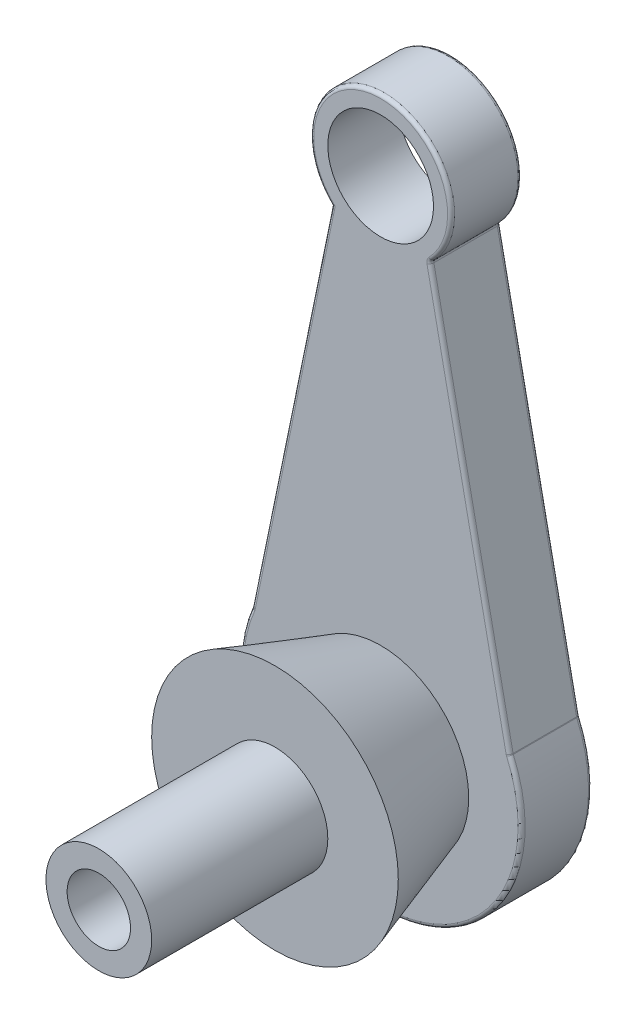
ISO-10303-21;
HEADER;
FILE_DESCRIPTION(('STEP AP214'),'2;1');
FILE_NAME('part.step','',(''),(''),'','','');
FILE_SCHEMA(('AUTOMOTIVE_DESIGN { 1 0 10303 214 1 1 1 1 }'));
ENDSEC;
DATA;
#1=APPLICATION_CONTEXT('core data for automotive mechanical design processes');
#2=APPLICATION_PROTOCOL_DEFINITION('international standard','automotive_design',2000,#1);
#3=PRODUCT_CONTEXT('',#1,'mechanical');
#4=PRODUCT('Part','Part','',(#3));
#5=PRODUCT_RELATED_PRODUCT_CATEGORY('part','',(#4));
#6=PRODUCT_DEFINITION_FORMATION('','',#4);
#7=PRODUCT_DEFINITION_CONTEXT('part definition',#1,'design');
#8=PRODUCT_DEFINITION('design','',#6,#7);
#9=PRODUCT_DEFINITION_SHAPE('','',#8);
#10=(LENGTH_UNIT() NAMED_UNIT(*) SI_UNIT(.MILLI.,.METRE.));
#11=(NAMED_UNIT(*) PLANE_ANGLE_UNIT() SI_UNIT($,.RADIAN.));
#12=(NAMED_UNIT(*) SI_UNIT($,.STERADIAN.) SOLID_ANGLE_UNIT());
#13=UNCERTAINTY_MEASURE_WITH_UNIT(LENGTH_MEASURE(1.E-05),#10,'distance_accuracy_value','');
#14=(GEOMETRIC_REPRESENTATION_CONTEXT(3) GLOBAL_UNCERTAINTY_ASSIGNED_CONTEXT((#13)) GLOBAL_UNIT_ASSIGNED_CONTEXT((#10,
#11,#12)) REPRESENTATION_CONTEXT('',''));
#15=CARTESIAN_POINT('',(0.,0.,0.));
#16=DIRECTION('',(0.,0.,1.));
#17=DIRECTION('',(1.,0.,0.));
#18=AXIS2_PLACEMENT_3D('',#15,#16,#17);
#19=CARTESIAN_POINT('',(0.,19.7994731740284,-10.));
#20=DIRECTION('',(0.,0.,-1.));
#21=DIRECTION('',(-1.,0.,0.));
#22=AXIS2_PLACEMENT_3D('',#19,#20,#21);
#23=PLANE('',#22);
#24=CARTESIAN_POINT('',(0.,19.7994731740284,-10.));
#25=DIRECTION('',(0.,0.,1.));
#26=DIRECTION('',(1.,0.,0.));
#27=AXIS2_PLACEMENT_3D('',#24,#25,#26);
#28=CIRCLE('',#27,7.5);
#29=CARTESIAN_POINT('',(7.5,19.7994731740284,-10.));
#30=VERTEX_POINT('',#29);
#31=EDGE_CURVE('E162',#30,#30,#28,.T.);
#32=ORIENTED_EDGE('',*,*,#31,.T.);
#33=EDGE_LOOP('',(#32));
#34=FACE_BOUND('',#33,.T.);
#35=CARTESIAN_POINT('',(0.,-50.4005268259715,-10.));
#36=DIRECTION('',(0.,0.,-1.));
#37=DIRECTION('',(-1.,0.,0.));
#38=AXIS2_PLACEMENT_3D('',#35,#36,#37);
#39=CIRCLE('',#38,13.);
#40=CARTESIAN_POINT('',(-13.,-50.4005268259715,-10.));
#41=VERTEX_POINT('',#40);
#42=EDGE_CURVE('E313',#41,#41,#39,.T.);
#43=ORIENTED_EDGE('',*,*,#42,.F.);
#44=EDGE_LOOP('',(#43));
#45=FACE_BOUND('',#44,.T.);
#46=CARTESIAN_POINT('',(-18.7837465075432,-42.1895057481543,-10.));
#47=DIRECTION('',(0.,0.,-1.));
#48=DIRECTION('',(-1.,0.,0.));
#49=AXIS2_PLACEMENT_3D('',#46,#47,#48);
#50=CIRCLE('',#49,1.);
#51=CARTESIAN_POINT('',(-17.8042230323169,-42.3908357297282,-10.));
#52=VERTEX_POINT('',#51);
#53=CARTESIAN_POINT('',(-17.8674661901021,-42.5900433617064,-10.));
#54=VERTEX_POINT('',#53);
#55=EDGE_CURVE('E195',#52,#54,#50,.T.);
#56=ORIENTED_EDGE('',*,*,#55,.F.);
#57=DIRECTION('',(-0.201329981573842,-0.979523475226335,0.));
#58=VECTOR('',#57,1.);
#59=CARTESIAN_POINT('',(-4.81815909070258,20.789791329218,-10.));
#60=LINE('',#59,#58);
#61=CARTESIAN_POINT('',(-6.45444816208308,12.828813311219,-10.));
#62=VERTEX_POINT('',#61);
#63=EDGE_CURVE('E193',#52,#62,#60,.F.);
#64=ORIENTED_EDGE('',*,*,#63,.T.);
#65=CARTESIAN_POINT('',(0.,19.7994731740284,-10.));
#66=DIRECTION('',(0.,0.,-1.));
#67=DIRECTION('',(-1.,0.,0.));
#68=AXIS2_PLACEMENT_3D('',#65,#66,#67);
#69=CIRCLE('',#68,9.5);
#70=CARTESIAN_POINT('',(6.82531586816918,13.1915186266879,-10.));
#71=VERTEX_POINT('',#70);
#72=EDGE_CURVE('E167',#62,#71,#69,.T.);
#73=ORIENTED_EDGE('',*,*,#72,.T.);
#74=CARTESIAN_POINT('',(7.54377017008172,12.49594446381,-10.));
#75=DIRECTION('',(0.,0.,-1.));
#76=DIRECTION('',(-1.,0.,0.));
#77=AXIS2_PLACEMENT_3D('',#74,#75,#76);
#78=CIRCLE('',#77,1.);
#79=CARTESIAN_POINT('',(6.56424669485539,12.2946144822362,-10.));
#80=VERTEX_POINT('',#79);
#81=EDGE_CURVE('E189',#80,#71,#78,.T.);
#82=ORIENTED_EDGE('',*,*,#81,.F.);
#83=DIRECTION('',(-0.201329981573842,0.979523475226335,0.));
#84=VECTOR('',#83,1.);
#85=CARTESIAN_POINT('',(4.81815909070258,20.789791329218,-10.));
#86=LINE('',#85,#84);
#87=CARTESIAN_POINT('',(17.8042230323169,-42.3908357297282,-10.));
#88=VERTEX_POINT('',#87);
#89=EDGE_CURVE('E180',#80,#88,#86,.F.);
#90=ORIENTED_EDGE('',*,*,#89,.T.);
#91=CARTESIAN_POINT('',(18.7837465075432,-42.1895057481543,-10.));
#92=DIRECTION('',(0.,0.,-1.));
#93=DIRECTION('',(-1.,0.,0.));
#94=AXIS2_PLACEMENT_3D('',#91,#92,#93);
#95=CIRCLE('',#94,1.);
#96=CARTESIAN_POINT('',(17.8674661901021,-42.5900433617064,-10.));
#97=VERTEX_POINT('',#96);
#98=EDGE_CURVE('E177',#97,#88,#95,.T.);
#99=ORIENTED_EDGE('',*,*,#98,.F.);
#100=CARTESIAN_POINT('',(0.,-50.4005268259715,-10.));
#101=DIRECTION('',(0.,0.,-1.));
#102=DIRECTION('',(-1.,0.,0.));
#103=AXIS2_PLACEMENT_3D('',#100,#101,#102);
#104=CIRCLE('',#103,19.5);
#105=EDGE_CURVE('E187',#97,#54,#104,.T.);
#106=ORIENTED_EDGE('',*,*,#105,.T.);
#107=EDGE_LOOP('',(#56,#64,#73,#82,#90,#99,#106));
#108=FACE_BOUND('',#107,.T.);
#109=ADVANCED_FACE('F40',(#34,#45,#108),#23,.T.);
#110=CARTESIAN_POINT('',(0.,19.7994731740284,-10.));
#111=DIRECTION('',(0.,0.,1.));
#112=DIRECTION('',(1.,0.,0.));
#113=AXIS2_PLACEMENT_3D('',#110,#111,#112);
#114=CYLINDRICAL_SURFACE('',#113,10.);
#115=DIRECTION('',(0.,0.,1.));
#116=VECTOR('',#115,1.);
#117=CARTESIAN_POINT('',(7.18454301912545,12.843731545249,-10.));
#118=LINE('',#117,#116);
#119=CARTESIAN_POINT('',(7.18454301912545,12.843731545249,-0.5));
#120=VERTEX_POINT('',#119);
#121=CARTESIAN_POINT('',(7.18454301912545,12.843731545249,-9.5));
#122=VERTEX_POINT('',#121);
#123=EDGE_CURVE('E146',#120,#122,#118,.F.);
#124=ORIENTED_EDGE('',*,*,#123,.T.);
#125=CARTESIAN_POINT('',(0.,19.7994731740284,-9.5));
#126=DIRECTION('',(0.,0.,-1.));
#127=DIRECTION('',(-1.,0.,0.));
#128=AXIS2_PLACEMENT_3D('',#125,#126,#127);
#129=CIRCLE('',#128,10.);
#130=CARTESIAN_POINT('',(-7.,12.6580447454856,-9.5));
#131=VERTEX_POINT('',#130);
#132=EDGE_CURVE('E140',#122,#131,#129,.F.);
#133=ORIENTED_EDGE('',*,*,#132,.T.);
#134=DIRECTION('',(0.,0.,1.));
#135=VECTOR('',#134,1.);
#136=CARTESIAN_POINT('',(-7.,12.6580447454856,-10.));
#137=LINE('',#136,#135);
#138=CARTESIAN_POINT('',(-7.,12.6580447454856,-0.5));
#139=VERTEX_POINT('',#138);
#140=EDGE_CURVE('E143',#131,#139,#137,.T.);
#141=ORIENTED_EDGE('',*,*,#140,.T.);
#142=CARTESIAN_POINT('',(0.,19.7994731740284,-0.5));
#143=DIRECTION('',(0.,0.,-1.));
#144=DIRECTION('',(-1.,0.,0.));
#145=AXIS2_PLACEMENT_3D('',#142,#143,#144);
#146=CIRCLE('',#145,10.);
#147=EDGE_CURVE('E152',#139,#120,#146,.T.);
#148=ORIENTED_EDGE('',*,*,#147,.T.);
#149=EDGE_LOOP('',(#124,#133,#141,#148));
#150=FACE_BOUND('',#149,.T.);
#151=ADVANCED_FACE('F142',(#150),#114,.T.);
#152=CARTESIAN_POINT('',(7.,12.6580447454856,-10.));
#153=DIRECTION('',(0.979523475226335,0.201329981573842,0.));
#154=DIRECTION('',(-0.201329981573842,0.979523475226335,0.));
#155=AXIS2_PLACEMENT_3D('',#152,#153,#154);
#156=PLANE('',#155);
#157=DIRECTION('',(-0.201329981573842,0.979523475226335,0.));
#158=VECTOR('',#157,1.);
#159=CARTESIAN_POINT('',(7.,12.6580447454856,-9.5));
#160=LINE('',#159,#158);
#161=CARTESIAN_POINT('',(18.29398476993,-42.2901707389412,-9.5));
#162=VERTEX_POINT('',#161);
#163=CARTESIAN_POINT('',(7.05400843246855,12.3952794730231,-9.5));
#164=VERTEX_POINT('',#163);
#165=EDGE_CURVE('E49',#162,#164,#160,.T.);
#166=ORIENTED_EDGE('',*,*,#165,.T.);
#167=DIRECTION('',(0.,0.,-1.));
#168=VECTOR('',#167,1.);
#169=CARTESIAN_POINT('',(7.05400843246855,12.3952794730231,0.));
#170=LINE('',#169,#168);
#171=CARTESIAN_POINT('',(7.05400843246855,12.3952794730231,-0.5));
#172=VERTEX_POINT('',#171);
#173=EDGE_CURVE('E12',#164,#172,#170,.F.);
#174=ORIENTED_EDGE('',*,*,#173,.T.);
#175=DIRECTION('',(-0.201329981573842,0.979523475226335,0.));
#176=VECTOR('',#175,1.);
#177=CARTESIAN_POINT('',(18.3046284919335,-42.3419552545144,-0.5));
#178=LINE('',#177,#176);
#179=CARTESIAN_POINT('',(18.29398476993,-42.2901707389412,-0.5));
#180=VERTEX_POINT('',#179);
#181=EDGE_CURVE('E225',#172,#180,#178,.F.);
#182=ORIENTED_EDGE('',*,*,#181,.T.);
#183=DIRECTION('',(0.,0.,-1.));
#184=VECTOR('',#183,1.);
#185=CARTESIAN_POINT('',(18.29398476993,-42.2901707389412,-10.));
#186=LINE('',#185,#184);
#187=EDGE_CURVE('E60',#180,#162,#186,.T.);
#188=ORIENTED_EDGE('',*,*,#187,.T.);
#189=EDGE_LOOP('',(#166,#174,#182,#188));
#190=FACE_BOUND('',#189,.T.);
#191=ADVANCED_FACE('F448',(#190),#156,.T.);
#192=CARTESIAN_POINT('',(0.,-50.4005268259715,-10.));
#193=DIRECTION('',(0.,0.,1.));
#194=DIRECTION('',(1.,0.,0.));
#195=AXIS2_PLACEMENT_3D('',#192,#193,#194);
#196=CYLINDRICAL_SURFACE('',#195,20.);
#197=DIRECTION('',(0.,0.,1.));
#198=VECTOR('',#197,1.);
#199=CARTESIAN_POINT('',(-18.3256063488226,-42.3897745549304,-10.));
#200=LINE('',#199,#198);
#201=CARTESIAN_POINT('',(-18.3256063488226,-42.3897745549304,-0.5));
#202=VERTEX_POINT('',#201);
#203=CARTESIAN_POINT('',(-18.3256063488226,-42.3897745549304,-9.5));
#204=VERTEX_POINT('',#203);
#205=EDGE_CURVE('E220',#202,#204,#200,.F.);
#206=ORIENTED_EDGE('',*,*,#205,.T.);
#207=CARTESIAN_POINT('',(0.,-50.4005268259715,-9.5));
#208=DIRECTION('',(0.,0.,-1.));
#209=DIRECTION('',(-1.,0.,0.));
#210=AXIS2_PLACEMENT_3D('',#207,#208,#209);
#211=CIRCLE('',#210,20.);
#212=CARTESIAN_POINT('',(18.3256063488226,-42.3897745549304,-9.5));
#213=VERTEX_POINT('',#212);
#214=EDGE_CURVE('E222',#204,#213,#211,.F.);
#215=ORIENTED_EDGE('',*,*,#214,.T.);
#216=DIRECTION('',(0.,0.,1.));
#217=VECTOR('',#216,1.);
#218=CARTESIAN_POINT('',(18.3256063488226,-42.3897745549304,-10.));
#219=LINE('',#218,#217);
#220=CARTESIAN_POINT('',(18.3256063488226,-42.3897745549304,-0.5));
#221=VERTEX_POINT('',#220);
#222=EDGE_CURVE('E151',#213,#221,#219,.T.);
#223=ORIENTED_EDGE('',*,*,#222,.T.);
#224=CARTESIAN_POINT('',(0.,-50.4005268259715,-0.5));
#225=DIRECTION('',(0.,0.,-1.));
#226=DIRECTION('',(-1.,0.,0.));
#227=AXIS2_PLACEMENT_3D('',#224,#225,#226);
#228=CIRCLE('',#227,20.);
#229=EDGE_CURVE('E218',#221,#202,#228,.T.);
#230=ORIENTED_EDGE('',*,*,#229,.T.);
#231=EDGE_LOOP('',(#206,#215,#223,#230));
#232=FACE_BOUND('',#231,.T.);
#233=ADVANCED_FACE('F438',(#232),#196,.T.);
#234=CARTESIAN_POINT('',(-7.,12.6580447454856,-10.));
#235=DIRECTION('',(-0.979523475226335,0.201329981573842,0.));
#236=DIRECTION('',(-0.201329981573842,-0.979523475226335,0.));
#237=AXIS2_PLACEMENT_3D('',#234,#235,#236);
#238=PLANE('',#237);
#239=ORIENTED_EDGE('',*,*,#140,.F.);
#240=DIRECTION('',(-0.201329981573842,-0.979523475226335,0.));
#241=VECTOR('',#240,1.);
#242=CARTESIAN_POINT('',(-7.,12.6580447454856,-9.5));
#243=LINE('',#242,#241);
#244=CARTESIAN_POINT('',(-18.29398476993,-42.2901707389413,-9.5));
#245=VERTEX_POINT('',#244);
#246=EDGE_CURVE('E158',#131,#245,#243,.T.);
#247=ORIENTED_EDGE('',*,*,#246,.T.);
#248=DIRECTION('',(0.,0.,-1.));
#249=VECTOR('',#248,1.);
#250=CARTESIAN_POINT('',(-18.29398476993,-42.2901707389413,0.));
#251=LINE('',#250,#249);
#252=CARTESIAN_POINT('',(-18.29398476993,-42.2901707389413,-0.5));
#253=VERTEX_POINT('',#252);
#254=EDGE_CURVE('E182',#245,#253,#251,.F.);
#255=ORIENTED_EDGE('',*,*,#254,.T.);
#256=DIRECTION('',(-0.201329981573842,-0.979523475226335,0.));
#257=VECTOR('',#256,1.);
#258=CARTESIAN_POINT('',(-7.,12.6580447454856,-0.5));
#259=LINE('',#258,#257);
#260=EDGE_CURVE('E160',#253,#139,#259,.F.);
#261=ORIENTED_EDGE('',*,*,#260,.T.);
#262=EDGE_LOOP('',(#239,#247,#255,#261));
#263=FACE_BOUND('',#262,.T.);
#264=ADVANCED_FACE('F156',(#263),#238,.T.);
#265=CARTESIAN_POINT('',(0.,19.7994731740284,0.));
#266=DIRECTION('',(0.,0.,-1.));
#267=DIRECTION('',(-1.,0.,0.));
#268=AXIS2_PLACEMENT_3D('',#265,#266,#267);
#269=PLANE('',#268);
#270=CARTESIAN_POINT('',(0.,19.7994731740284,0.));
#271=DIRECTION('',(0.,0.,-1.));
#272=DIRECTION('',(-1.,0.,0.));
#273=AXIS2_PLACEMENT_3D('',#270,#271,#272);
#274=CIRCLE('',#273,9.5);
#275=CARTESIAN_POINT('',(6.82531586816918,13.1915186266879,0.));
#276=VERTEX_POINT('',#275);
#277=CARTESIAN_POINT('',(-6.45444816208308,12.828813311219,0.));
#278=VERTEX_POINT('',#277);
#279=EDGE_CURVE('E208',#276,#278,#274,.F.);
#280=ORIENTED_EDGE('',*,*,#279,.T.);
#281=DIRECTION('',(-0.201329981573842,-0.979523475226335,0.));
#282=VECTOR('',#281,1.);
#283=CARTESIAN_POINT('',(-17.8148667543203,-42.4426202453013,0.));
#284=LINE('',#283,#282);
#285=CARTESIAN_POINT('',(-17.8042230323169,-42.3908357297282,0.));
#286=VERTEX_POINT('',#285);
#287=EDGE_CURVE('E212',#278,#286,#284,.T.);
#288=ORIENTED_EDGE('',*,*,#287,.T.);
#289=CARTESIAN_POINT('',(-18.7837465075432,-42.1895057481543,0.));
#290=DIRECTION('',(0.,0.,-1.));
#291=DIRECTION('',(-1.,0.,0.));
#292=AXIS2_PLACEMENT_3D('',#289,#290,#291);
#293=CIRCLE('',#292,1.);
#294=CARTESIAN_POINT('',(-17.8674661901021,-42.5900433617064,0.));
#295=VERTEX_POINT('',#294);
#296=EDGE_CURVE('E210',#295,#286,#293,.F.);
#297=ORIENTED_EDGE('',*,*,#296,.F.);
#298=CARTESIAN_POINT('',(0.,-50.4005268259715,0.));
#299=DIRECTION('',(0.,0.,-1.));
#300=DIRECTION('',(-1.,0.,0.));
#301=AXIS2_PLACEMENT_3D('',#298,#299,#300);
#302=CIRCLE('',#301,19.5);
#303=CARTESIAN_POINT('',(17.8674661901021,-42.5900433617064,0.));
#304=VERTEX_POINT('',#303);
#305=EDGE_CURVE('E206',#295,#304,#302,.F.);
#306=ORIENTED_EDGE('',*,*,#305,.T.);
#307=CARTESIAN_POINT('',(18.7837465075432,-42.1895057481543,0.));
#308=DIRECTION('',(0.,0.,-1.));
#309=DIRECTION('',(-1.,0.,0.));
#310=AXIS2_PLACEMENT_3D('',#307,#308,#309);
#311=CIRCLE('',#310,1.);
#312=CARTESIAN_POINT('',(17.8042230323169,-42.3908357297282,0.));
#313=VERTEX_POINT('',#312);
#314=EDGE_CURVE('E203',#313,#304,#311,.F.);
#315=ORIENTED_EDGE('',*,*,#314,.F.);
#316=DIRECTION('',(-0.201329981573842,0.979523475226335,0.));
#317=VECTOR('',#316,1.);
#318=CARTESIAN_POINT('',(6.51023826238683,12.5573797546987,0.));
#319=LINE('',#318,#317);
#320=CARTESIAN_POINT('',(6.56424669485539,12.2946144822362,0.));
#321=VERTEX_POINT('',#320);
#322=EDGE_CURVE('E201',#313,#321,#319,.T.);
#323=ORIENTED_EDGE('',*,*,#322,.T.);
#324=CARTESIAN_POINT('',(7.54377017008172,12.49594446381,0.));
#325=DIRECTION('',(0.,0.,-1.));
#326=DIRECTION('',(-1.,0.,0.));
#327=AXIS2_PLACEMENT_3D('',#324,#325,#326);
#328=CIRCLE('',#327,1.);
#329=EDGE_CURVE('E198',#276,#321,#328,.F.);
#330=ORIENTED_EDGE('',*,*,#329,.F.);
#331=EDGE_LOOP('',(#280,#288,#297,#306,#315,#323,#330));
#332=FACE_BOUND('',#331,.T.);
#333=CARTESIAN_POINT('',(0.,-50.4005268259715,0.));
#334=DIRECTION('',(0.,0.,1.));
#335=DIRECTION('',(1.,0.,0.));
#336=AXIS2_PLACEMENT_3D('',#333,#334,#335);
#337=CIRCLE('',#336,12.5);
#338=CARTESIAN_POINT('',(12.5,-50.4005268259715,0.));
#339=VERTEX_POINT('',#338);
#340=EDGE_CURVE('E329',#339,#339,#337,.T.);
#341=ORIENTED_EDGE('',*,*,#340,.F.);
#342=EDGE_LOOP('',(#341));
#343=FACE_BOUND('',#342,.T.);
#344=CARTESIAN_POINT('',(0.,19.7994731740284,0.));
#345=DIRECTION('',(0.,0.,1.));
#346=DIRECTION('',(1.,0.,0.));
#347=AXIS2_PLACEMENT_3D('',#344,#345,#346);
#348=CIRCLE('',#347,7.5);
#349=CARTESIAN_POINT('',(7.5,19.7994731740284,0.));
#350=VERTEX_POINT('',#349);
#351=EDGE_CURVE('E372',#350,#350,#348,.T.);
#352=ORIENTED_EDGE('',*,*,#351,.F.);
#353=EDGE_LOOP('',(#352));
#354=FACE_BOUND('',#353,.T.);
#355=ADVANCED_FACE('F423',(#332,#343,#354),#269,.F.);
#356=CARTESIAN_POINT('',(0.,19.7994731740284,-10.));
#357=DIRECTION('',(0.,0.,1.));
#358=DIRECTION('',(1.,0.,0.));
#359=AXIS2_PLACEMENT_3D('',#356,#357,#358);
#360=CYLINDRICAL_SURFACE('',#359,7.5);
#361=ORIENTED_EDGE('',*,*,#31,.F.);
#362=EDGE_LOOP('',(#361));
#363=FACE_BOUND('',#362,.T.);
#364=ORIENTED_EDGE('',*,*,#351,.T.);
#365=EDGE_LOOP('',(#364));
#366=FACE_BOUND('',#365,.T.);
#367=ADVANCED_FACE('F359',(#363,#366),#360,.F.);
#368=CARTESIAN_POINT('',(0.,-50.4005268259715,15.));
#369=DIRECTION('',(0.,0.,1.));
#370=DIRECTION('',(1.,0.,0.));
#371=AXIS2_PLACEMENT_3D('',#368,#369,#370);
#372=PLANE('',#371);
#373=CARTESIAN_POINT('',(0.,-50.4005268259715,15.));
#374=DIRECTION('',(0.,0.,1.));
#375=DIRECTION('',(1.,0.,0.));
#376=AXIS2_PLACEMENT_3D('',#373,#374,#375);
#377=CIRCLE('',#376,7.5);
#378=CARTESIAN_POINT('',(7.50000000000001,-50.4005268259715,15.));
#379=VERTEX_POINT('',#378);
#380=EDGE_CURVE('E161',#379,#379,#377,.T.);
#381=ORIENTED_EDGE('',*,*,#380,.F.);
#382=EDGE_LOOP('',(#381));
#383=FACE_BOUND('',#382,.T.);
#384=CARTESIAN_POINT('',(0.,-50.4005268259715,15.));
#385=DIRECTION('',(0.,0.,1.));
#386=DIRECTION('',(1.,0.,0.));
#387=AXIS2_PLACEMENT_3D('',#384,#385,#386);
#388=CIRCLE('',#387,17.5);
#389=CARTESIAN_POINT('',(17.5,-50.4005268259715,15.));
#390=VERTEX_POINT('',#389);
#391=EDGE_CURVE('E336',#390,#390,#388,.T.);
#392=ORIENTED_EDGE('',*,*,#391,.T.);
#393=EDGE_LOOP('',(#392));
#394=FACE_BOUND('',#393,.T.);
#395=ADVANCED_FACE('F353',(#383,#394),#372,.T.);
#396=CARTESIAN_POINT('',(0.,-50.4005268259715,0.));
#397=DIRECTION('',(0.,0.,1.));
#398=DIRECTION('',(1.,0.,0.));
#399=AXIS2_PLACEMENT_3D('',#396,#397,#398);
#400=CONICAL_SURFACE('',#399,12.5,0.321750554396642);
#401=ORIENTED_EDGE('',*,*,#340,.T.);
#402=EDGE_LOOP('',(#401));
#403=FACE_BOUND('',#402,.T.);
#404=ORIENTED_EDGE('',*,*,#391,.F.);
#405=EDGE_LOOP('',(#404));
#406=FACE_BOUND('',#405,.T.);
#407=ADVANCED_FACE('F342',(#403,#406),#400,.T.);
#408=CARTESIAN_POINT('',(0.,-50.4005268259715,40.));
#409=DIRECTION('',(0.,0.,-1.));
#410=DIRECTION('',(-1.,0.,0.));
#411=AXIS2_PLACEMENT_3D('',#408,#409,#410);
#412=CYLINDRICAL_SURFACE('',#411,7.5);
#413=CARTESIAN_POINT('',(0.,-50.4005268259715,40.));
#414=DIRECTION('',(0.,0.,1.));
#415=DIRECTION('',(1.,0.,0.));
#416=AXIS2_PLACEMENT_3D('',#413,#414,#415);
#417=CIRCLE('',#416,7.5);
#418=CARTESIAN_POINT('',(7.50000000000001,-50.4005268259715,40.));
#419=VERTEX_POINT('',#418);
#420=EDGE_CURVE('E323',#419,#419,#417,.T.);
#421=ORIENTED_EDGE('',*,*,#420,.F.);
#422=EDGE_LOOP('',(#421));
#423=FACE_BOUND('',#422,.T.);
#424=ORIENTED_EDGE('',*,*,#380,.T.);
#425=EDGE_LOOP('',(#424));
#426=FACE_BOUND('',#425,.T.);
#427=ADVANCED_FACE('F352',(#423,#426),#412,.T.);
#428=CARTESIAN_POINT('',(0.,-50.4005268259715,40.));
#429=DIRECTION('',(0.,0.,1.));
#430=DIRECTION('',(1.,0.,0.));
#431=AXIS2_PLACEMENT_3D('',#428,#429,#430);
#432=PLANE('',#431);
#433=CARTESIAN_POINT('',(0.,-50.4005268259715,40.));
#434=DIRECTION('',(0.,0.,1.));
#435=DIRECTION('',(1.,0.,0.));
#436=AXIS2_PLACEMENT_3D('',#433,#434,#435);
#437=CIRCLE('',#436,4.5);
#438=CARTESIAN_POINT('',(4.5,-50.4005268259715,40.));
#439=VERTEX_POINT('',#438);
#440=EDGE_CURVE('E668',#439,#439,#437,.F.);
#441=ORIENTED_EDGE('',*,*,#440,.T.);
#442=EDGE_LOOP('',(#441));
#443=FACE_BOUND('',#442,.T.);
#444=ORIENTED_EDGE('',*,*,#420,.T.);
#445=EDGE_LOOP('',(#444));
#446=FACE_BOUND('',#445,.T.);
#447=ADVANCED_FACE('F487',(#443,#446),#432,.T.);
#448=CARTESIAN_POINT('',(0.,-50.4005268259715,-2.3));
#449=DIRECTION('',(0.,0.,-1.));
#450=DIRECTION('',(-1.,0.,0.));
#451=AXIS2_PLACEMENT_3D('',#448,#449,#450);
#452=CYLINDRICAL_SURFACE('',#451,13.);
#453=CARTESIAN_POINT('',(0.,-50.4005268259715,-2.3));
#454=DIRECTION('',(0.,0.,-1.));
#455=DIRECTION('',(-1.,0.,0.));
#456=AXIS2_PLACEMENT_3D('',#453,#454,#455);
#457=CIRCLE('',#456,13.);
#458=CARTESIAN_POINT('',(-13.,-50.4005268259715,-2.3));
#459=VERTEX_POINT('',#458);
#460=EDGE_CURVE('E318',#459,#459,#457,.T.);
#461=ORIENTED_EDGE('',*,*,#460,.F.);
#462=EDGE_LOOP('',(#461));
#463=FACE_BOUND('',#462,.T.);
#464=ORIENTED_EDGE('',*,*,#42,.T.);
#465=EDGE_LOOP('',(#464));
#466=FACE_BOUND('',#465,.T.);
#467=ADVANCED_FACE('F495',(#463,#466),#452,.F.);
#468=CARTESIAN_POINT('',(0.,-50.4005268259715,-2.3));
#469=DIRECTION('',(0.,0.,-1.));
#470=DIRECTION('',(-1.,0.,0.));
#471=AXIS2_PLACEMENT_3D('',#468,#469,#470);
#472=PLANE('',#471);
#473=CARTESIAN_POINT('',(0.,-50.4005268259715,-2.3));
#474=DIRECTION('',(0.,0.,-1.));
#475=DIRECTION('',(-1.,0.,0.));
#476=AXIS2_PLACEMENT_3D('',#473,#474,#475);
#477=CIRCLE('',#476,4.5);
#478=CARTESIAN_POINT('',(-4.49999999999999,-50.4005268259715,-2.3));
#479=VERTEX_POINT('',#478);
#480=EDGE_CURVE('E229',#479,#479,#477,.T.);
#481=ORIENTED_EDGE('',*,*,#480,.F.);
#482=EDGE_LOOP('',(#481));
#483=FACE_BOUND('',#482,.T.);
#484=ORIENTED_EDGE('',*,*,#460,.T.);
#485=EDGE_LOOP('',(#484));
#486=FACE_BOUND('',#485,.T.);
#487=ADVANCED_FACE('F503',(#483,#486),#472,.T.);
#488=CARTESIAN_POINT('',(4.81815909070258,20.789791329218,-0.5));
#489=DIRECTION('',(0.201329981573842,-0.979523475226335,0.));
#490=DIRECTION('',(0.979523475226335,0.201329981573842,0.));
#491=AXIS2_PLACEMENT_3D('',#488,#489,#490);
#492=CYLINDRICAL_SURFACE('',#491,0.5);
#493=CARTESIAN_POINT('',(6.56424669485539,12.2946144822362,-0.5));
#494=DIRECTION('',(-0.201329981573843,0.979523475226335,0.));
#495=DIRECTION('',(-0.979523475226335,-0.201329981573843,0.));
#496=AXIS2_PLACEMENT_3D('',#493,#494,#495);
#497=CIRCLE('',#496,0.5);
#498=EDGE_CURVE('E306',#321,#172,#497,.T.);
#499=ORIENTED_EDGE('',*,*,#498,.F.);
#500=ORIENTED_EDGE('',*,*,#322,.F.);
#501=CARTESIAN_POINT('',(17.8042230323169,-42.3908357297282,-0.5));
#502=DIRECTION('',(0.201329981573837,-0.979523475226336,0.));
#503=DIRECTION('',(0.979523475226336,0.201329981573837,0.));
#504=AXIS2_PLACEMENT_3D('',#501,#502,#503);
#505=CIRCLE('',#504,0.5);
#506=EDGE_CURVE('E44',#180,#313,#505,.T.);
#507=ORIENTED_EDGE('',*,*,#506,.F.);
#508=ORIENTED_EDGE('',*,*,#181,.F.);
#509=EDGE_LOOP('',(#499,#500,#507,#508));
#510=FACE_BOUND('',#509,.T.);
#511=ADVANCED_FACE('F42',(#510),#492,.T.);
#512=CARTESIAN_POINT('',(0.,19.7994731740284,-0.5));
#513=DIRECTION('',(0.,0.,-1.));
#514=DIRECTION('',(-1.,0.,0.));
#515=AXIS2_PLACEMENT_3D('',#512,#513,#514);
#516=TOROIDAL_SURFACE('',#515,9.5,0.5);
#517=CARTESIAN_POINT('',(-7.,12.6580447454856,-0.5));
#518=CARTESIAN_POINT('',(-7.000035363539,12.6580346648433,-0.474337589161815));
#519=CARTESIAN_POINT('',(-6.99785049523431,12.6587010589138,-0.448701564209454));
#520=CARTESIAN_POINT('',(-6.9893242716248,12.6613055157247,-0.39829701135014));
#521=CARTESIAN_POINT('',(-6.98299936110823,12.6632385472479,-0.373525457998961));
#522=CARTESIAN_POINT('',(-6.96647887430448,12.6682943511436,-0.325467662750464));
#523=CARTESIAN_POINT('',(-6.95628603505664,12.6714162822277,-0.302180384122913));
#524=CARTESIAN_POINT('',(-6.93247293951728,12.6787235667432,-0.257604139797611));
#525=CARTESIAN_POINT('',(-6.91885023983259,12.6829096783052,-0.236316613608572));
#526=CARTESIAN_POINT('',(-6.88797791590271,12.692417925464,-0.195220995484103));
#527=CARTESIAN_POINT('',(-6.87058862189201,12.6977839845666,-0.175528421823951));
#528=CARTESIAN_POINT('',(-6.8332042133352,12.7093519252291,-0.139094670709879));
#529=CARTESIAN_POINT('',(-6.81320839696103,12.7155540319174,-0.122354291025727));
#530=CARTESIAN_POINT('',(-6.76874160004396,12.7293882743804,-0.0902482485667253));
#531=CARTESIAN_POINT('',(-6.74402049444145,12.7371028407132,-0.0752649474611391));
#532=CARTESIAN_POINT('',(-6.69273263597337,12.7531669104083,-0.0493101611347269));
#533=CARTESIAN_POINT('',(-6.6661641992676,12.7615169937172,-0.0383423946556227));
#534=CARTESIAN_POINT('',(-6.60988261583341,12.7792739918598,-0.0198329273745968));
#535=CARTESIAN_POINT('',(-6.58008071967872,12.7887137247645,-0.0125943098574713));
#536=CARTESIAN_POINT('',(-6.51985606394669,12.8078716198739,-0.00280868162339645));
#537=CARTESIAN_POINT('',(-6.48943469679885,12.8175891740109,-0.00025211857164994));
#538=CARTESIAN_POINT('',(-6.45751728059508,12.8278284061649,-5.90352309394239E-06));
#539=CARTESIAN_POINT('',(-6.45598264759499,12.828320828946,1.03010997552403E-08));
#540=CARTESIAN_POINT('',(-6.45444816208307,12.828813311219,0.));
#541=B_SPLINE_CURVE_WITH_KNOTS('',3,(#517,#518,#519,#520,#521,#522,#523,#524,#525,#526,#527,
#528,#529,#530,#531,#532,#533,#534,#535,#536,#537,#538,#539,#540),.UNSPECIFIED.,.F.,.F.,(4,2,2,
2,2,2,2,2,2,2,2,4),(0.,0.0768444175256979,0.153385436303273,0.229872393510998,0.306413994088526,
0.386530152365074,0.466667927322912,0.556065605167722,0.645545865032258,0.741460651348247,
0.837179533235271,0.84201461627667),.UNSPECIFIED.);
#542=EDGE_CURVE('E294',#278,#139,#541,.F.);
#543=ORIENTED_EDGE('',*,*,#542,.F.);
#544=ORIENTED_EDGE('',*,*,#279,.F.);
#545=CARTESIAN_POINT('',(6.82531586816918,13.1915186266879,-0.5));
#546=DIRECTION('',(-0.695574162877948,-0.718454301912545,0.));
#547=DIRECTION('',(0.718454301912545,-0.695574162877948,0.));
#548=AXIS2_PLACEMENT_3D('',#545,#546,#547);
#549=CIRCLE('',#548,0.5);
#550=EDGE_CURVE('E302',#120,#276,#549,.T.);
#551=ORIENTED_EDGE('',*,*,#550,.F.);
#552=ORIENTED_EDGE('',*,*,#147,.F.);
#553=EDGE_LOOP('',(#543,#544,#551,#552));
#554=FACE_BOUND('',#553,.T.);
#555=ADVANCED_FACE('F290',(#554),#516,.T.);
#556=CARTESIAN_POINT('',(18.7837465075432,-42.1895057481543,-0.5));
#557=DIRECTION('',(0.,0.,-1.));
#558=DIRECTION('',(-1.,0.,0.));
#559=AXIS2_PLACEMENT_3D('',#556,#557,#558);
#560=TOROIDAL_SURFACE('',#559,1.,0.5);
#561=ORIENTED_EDGE('',*,*,#506,.T.);
#562=ORIENTED_EDGE('',*,*,#314,.T.);
#563=CARTESIAN_POINT('',(17.8674661901021,-42.5900433617064,-0.5));
#564=DIRECTION('',(-0.400537613552064,0.91628031744113,0.));
#565=DIRECTION('',(-0.91628031744113,-0.400537613552064,0.));
#566=AXIS2_PLACEMENT_3D('',#563,#564,#565);
#567=CIRCLE('',#566,0.5);
#568=EDGE_CURVE('E303',#221,#304,#567,.F.);
#569=ORIENTED_EDGE('',*,*,#568,.F.);
#570=CARTESIAN_POINT('',(18.7837465075432,-42.1895057481543,-0.5));
#571=DIRECTION('',(0.,0.,-1.));
#572=DIRECTION('',(-1.,0.,0.));
#573=AXIS2_PLACEMENT_3D('',#570,#571,#572);
#574=CIRCLE('',#573,0.5);
#575=EDGE_CURVE('E412',#180,#221,#574,.F.);
#576=ORIENTED_EDGE('',*,*,#575,.F.);
#577=EDGE_LOOP('',(#561,#562,#569,#576));
#578=FACE_BOUND('',#577,.T.);
#579=ADVANCED_FACE('F420',(#578),#560,.T.);
#580=CARTESIAN_POINT('',(7.54377017008172,12.49594446381,-0.5));
#581=DIRECTION('',(0.,0.,-1.));
#582=DIRECTION('',(-1.,0.,0.));
#583=AXIS2_PLACEMENT_3D('',#580,#581,#582);
#584=TOROIDAL_SURFACE('',#583,1.,0.5);
#585=ORIENTED_EDGE('',*,*,#329,.T.);
#586=ORIENTED_EDGE('',*,*,#498,.T.);
#587=CARTESIAN_POINT('',(7.54377017008172,12.49594446381,-0.5));
#588=DIRECTION('',(0.,0.,-1.));
#589=DIRECTION('',(-1.,0.,0.));
#590=AXIS2_PLACEMENT_3D('',#587,#588,#589);
#591=CIRCLE('',#590,0.5);
#592=EDGE_CURVE('E390',#120,#172,#591,.F.);
#593=ORIENTED_EDGE('',*,*,#592,.F.);
#594=ORIENTED_EDGE('',*,*,#550,.T.);
#595=EDGE_LOOP('',(#585,#586,#593,#594));
#596=FACE_BOUND('',#595,.T.);
#597=ADVANCED_FACE('F288',(#596),#584,.T.);
#598=CARTESIAN_POINT('',(-4.81815909070258,20.789791329218,-0.5));
#599=DIRECTION('',(0.201329981573842,0.979523475226335,0.));
#600=DIRECTION('',(-0.979523475226335,0.201329981573842,0.));
#601=AXIS2_PLACEMENT_3D('',#598,#599,#600);
#602=CYLINDRICAL_SURFACE('',#601,0.5);
#603=ORIENTED_EDGE('',*,*,#542,.T.);
#604=ORIENTED_EDGE('',*,*,#260,.F.);
#605=CARTESIAN_POINT('',(-17.8042230323169,-42.3908357297282,-0.5));
#606=DIRECTION('',(-0.201329981573837,-0.979523475226336,0.));
#607=DIRECTION('',(0.979523475226336,-0.201329981573837,0.));
#608=AXIS2_PLACEMENT_3D('',#605,#606,#607);
#609=CIRCLE('',#608,0.5);
#610=EDGE_CURVE('E384',#286,#253,#609,.T.);
#611=ORIENTED_EDGE('',*,*,#610,.F.);
#612=ORIENTED_EDGE('',*,*,#287,.F.);
#613=EDGE_LOOP('',(#603,#604,#611,#612));
#614=FACE_BOUND('',#613,.T.);
#615=ADVANCED_FACE('F283',(#614),#602,.T.);
#616=CARTESIAN_POINT('',(0.,-50.4005268259715,-0.5));
#617=DIRECTION('',(0.,0.,-1.));
#618=DIRECTION('',(-1.,0.,0.));
#619=AXIS2_PLACEMENT_3D('',#616,#617,#618);
#620=TOROIDAL_SURFACE('',#619,19.5,0.5);
#621=ORIENTED_EDGE('',*,*,#568,.T.);
#622=ORIENTED_EDGE('',*,*,#305,.F.);
#623=CARTESIAN_POINT('',(-17.8674661901021,-42.5900433617064,-0.5));
#624=DIRECTION('',(0.400537613552061,0.916280317441131,0.));
#625=DIRECTION('',(-0.916280317441131,0.400537613552061,0.));
#626=AXIS2_PLACEMENT_3D('',#623,#624,#625);
#627=CIRCLE('',#626,0.5);
#628=EDGE_CURVE('E391',#202,#295,#627,.T.);
#629=ORIENTED_EDGE('',*,*,#628,.F.);
#630=ORIENTED_EDGE('',*,*,#229,.F.);
#631=EDGE_LOOP('',(#621,#622,#629,#630));
#632=FACE_BOUND('',#631,.T.);
#633=ADVANCED_FACE('F279',(#632),#620,.T.);
#634=CARTESIAN_POINT('',(18.7837465075432,-42.1895057481543,-10.));
#635=DIRECTION('',(0.,0.,1.));
#636=DIRECTION('',(1.,0.,0.));
#637=AXIS2_PLACEMENT_3D('',#634,#635,#636);
#638=CYLINDRICAL_SURFACE('',#637,0.5);
#639=ORIENTED_EDGE('',*,*,#575,.T.);
#640=ORIENTED_EDGE('',*,*,#222,.F.);
#641=CARTESIAN_POINT('',(18.7837465075432,-42.1895057481543,-9.5));
#642=DIRECTION('',(0.,0.,-1.));
#643=DIRECTION('',(-1.,0.,0.));
#644=AXIS2_PLACEMENT_3D('',#641,#642,#643);
#645=CIRCLE('',#644,0.5);
#646=EDGE_CURVE('E408',#162,#213,#645,.F.);
#647=ORIENTED_EDGE('',*,*,#646,.F.);
#648=ORIENTED_EDGE('',*,*,#187,.F.);
#649=EDGE_LOOP('',(#639,#640,#647,#648));
#650=FACE_BOUND('',#649,.T.);
#651=ADVANCED_FACE('F275',(#650),#638,.F.);
#652=CARTESIAN_POINT('',(6.51023826238683,12.5573797546987,-9.5));
#653=DIRECTION('',(-0.201329981573842,0.979523475226335,0.));
#654=DIRECTION('',(-0.979523475226335,-0.201329981573842,0.));
#655=AXIS2_PLACEMENT_3D('',#652,#653,#654);
#656=CYLINDRICAL_SURFACE('',#655,0.5);
#657=CARTESIAN_POINT('',(6.56424669485539,12.2946144822362,-9.5));
#658=DIRECTION('',(-0.201329981573843,0.979523475226335,0.));
#659=DIRECTION('',(-0.979523475226335,-0.201329981573843,0.));
#660=AXIS2_PLACEMENT_3D('',#657,#658,#659);
#661=CIRCLE('',#660,0.5);
#662=EDGE_CURVE('E397',#164,#80,#661,.T.);
#663=ORIENTED_EDGE('',*,*,#662,.F.);
#664=ORIENTED_EDGE('',*,*,#165,.F.);
#665=CARTESIAN_POINT('',(17.8042230323169,-42.3908357297282,-9.5));
#666=DIRECTION('',(0.201329981573835,-0.979523475226336,0.));
#667=DIRECTION('',(0.979523475226336,0.201329981573835,0.));
#668=AXIS2_PLACEMENT_3D('',#665,#666,#667);
#669=CIRCLE('',#668,0.5);
#670=EDGE_CURVE('E405',#88,#162,#669,.T.);
#671=ORIENTED_EDGE('',*,*,#670,.F.);
#672=ORIENTED_EDGE('',*,*,#89,.F.);
#673=EDGE_LOOP('',(#663,#664,#671,#672));
#674=FACE_BOUND('',#673,.T.);
#675=ADVANCED_FACE('F271',(#674),#656,.T.);
#676=CARTESIAN_POINT('',(7.54377017008172,12.49594446381,-10.));
#677=DIRECTION('',(0.,0.,1.));
#678=DIRECTION('',(1.,0.,0.));
#679=AXIS2_PLACEMENT_3D('',#676,#677,#678);
#680=CYLINDRICAL_SURFACE('',#679,0.5);
#681=ORIENTED_EDGE('',*,*,#592,.T.);
#682=ORIENTED_EDGE('',*,*,#173,.F.);
#683=CARTESIAN_POINT('',(7.54377017008172,12.49594446381,-9.5));
#684=DIRECTION('',(0.,0.,-1.));
#685=DIRECTION('',(-1.,0.,0.));
#686=AXIS2_PLACEMENT_3D('',#683,#684,#685);
#687=CIRCLE('',#686,0.5);
#688=EDGE_CURVE('E393',#122,#164,#687,.F.);
#689=ORIENTED_EDGE('',*,*,#688,.F.);
#690=ORIENTED_EDGE('',*,*,#123,.F.);
#691=EDGE_LOOP('',(#681,#682,#689,#690));
#692=FACE_BOUND('',#691,.T.);
#693=ADVANCED_FACE('F267',(#692),#680,.F.);
#694=CARTESIAN_POINT('',(-18.7837465075432,-42.1895057481543,-0.5));
#695=DIRECTION('',(0.,0.,-1.));
#696=DIRECTION('',(-1.,0.,0.));
#697=AXIS2_PLACEMENT_3D('',#694,#695,#696);
#698=TOROIDAL_SURFACE('',#697,1.,0.5);
#699=ORIENTED_EDGE('',*,*,#296,.T.);
#700=ORIENTED_EDGE('',*,*,#610,.T.);
#701=CARTESIAN_POINT('',(-18.7837465075432,-42.1895057481543,-0.5));
#702=DIRECTION('',(0.,0.,-1.));
#703=DIRECTION('',(-1.,0.,0.));
#704=AXIS2_PLACEMENT_3D('',#701,#702,#703);
#705=CIRCLE('',#704,0.5);
#706=EDGE_CURVE('E388',#202,#253,#705,.F.);
#707=ORIENTED_EDGE('',*,*,#706,.F.);
#708=ORIENTED_EDGE('',*,*,#628,.T.);
#709=EDGE_LOOP('',(#699,#700,#707,#708));
#710=FACE_BOUND('',#709,.T.);
#711=ADVANCED_FACE('F263',(#710),#698,.T.);
#712=CARTESIAN_POINT('',(18.7837465075432,-42.1895057481543,-9.5));
#713=DIRECTION('',(0.,0.,-1.));
#714=DIRECTION('',(-1.,0.,0.));
#715=AXIS2_PLACEMENT_3D('',#712,#713,#714);
#716=TOROIDAL_SURFACE('',#715,1.,0.5);
#717=ORIENTED_EDGE('',*,*,#670,.T.);
#718=ORIENTED_EDGE('',*,*,#646,.T.);
#719=CARTESIAN_POINT('',(17.8674661901021,-42.5900433617064,-9.5));
#720=DIRECTION('',(-0.400537613552061,0.916280317441131,0.));
#721=DIRECTION('',(-0.916280317441131,-0.400537613552061,0.));
#722=AXIS2_PLACEMENT_3D('',#719,#720,#721);
#723=CIRCLE('',#722,0.5);
#724=EDGE_CURVE('E394',#97,#213,#723,.F.);
#725=ORIENTED_EDGE('',*,*,#724,.F.);
#726=ORIENTED_EDGE('',*,*,#98,.T.);
#727=EDGE_LOOP('',(#717,#718,#725,#726));
#728=FACE_BOUND('',#727,.T.);
#729=ADVANCED_FACE('F259',(#728),#716,.T.);
#730=CARTESIAN_POINT('',(7.54377017008172,12.49594446381,-9.5));
#731=DIRECTION('',(0.,0.,-1.));
#732=DIRECTION('',(-1.,0.,0.));
#733=AXIS2_PLACEMENT_3D('',#730,#731,#732);
#734=TOROIDAL_SURFACE('',#733,1.,0.5);
#735=ORIENTED_EDGE('',*,*,#662,.T.);
#736=ORIENTED_EDGE('',*,*,#81,.T.);
#737=CARTESIAN_POINT('',(6.82531586816918,13.1915186266879,-9.5));
#738=DIRECTION('',(-0.695574162877948,-0.718454301912545,0.));
#739=DIRECTION('',(0.718454301912545,-0.695574162877948,0.));
#740=AXIS2_PLACEMENT_3D('',#737,#738,#739);
#741=CIRCLE('',#740,0.5);
#742=EDGE_CURVE('E399',#122,#71,#741,.F.);
#743=ORIENTED_EDGE('',*,*,#742,.F.);
#744=ORIENTED_EDGE('',*,*,#688,.T.);
#745=EDGE_LOOP('',(#735,#736,#743,#744));
#746=FACE_BOUND('',#745,.T.);
#747=ADVANCED_FACE('F255',(#746),#734,.T.);
#748=CARTESIAN_POINT('',(-18.7837465075432,-42.1895057481543,-10.));
#749=DIRECTION('',(0.,0.,1.));
#750=DIRECTION('',(1.,0.,0.));
#751=AXIS2_PLACEMENT_3D('',#748,#749,#750);
#752=CYLINDRICAL_SURFACE('',#751,0.5);
#753=ORIENTED_EDGE('',*,*,#706,.T.);
#754=ORIENTED_EDGE('',*,*,#254,.F.);
#755=CARTESIAN_POINT('',(-18.7837465075432,-42.1895057481543,-9.5));
#756=DIRECTION('',(0.,0.,-1.));
#757=DIRECTION('',(-1.,0.,0.));
#758=AXIS2_PLACEMENT_3D('',#755,#756,#757);
#759=CIRCLE('',#758,0.5);
#760=EDGE_CURVE('E431',#204,#245,#759,.F.);
#761=ORIENTED_EDGE('',*,*,#760,.F.);
#762=ORIENTED_EDGE('',*,*,#205,.F.);
#763=EDGE_LOOP('',(#753,#754,#761,#762));
#764=FACE_BOUND('',#763,.T.);
#765=ADVANCED_FACE('F251',(#764),#752,.F.);
#766=CARTESIAN_POINT('',(0.,-50.4005268259715,-9.5));
#767=DIRECTION('',(0.,0.,-1.));
#768=DIRECTION('',(-1.,0.,0.));
#769=AXIS2_PLACEMENT_3D('',#766,#767,#768);
#770=TOROIDAL_SURFACE('',#769,19.5,0.5);
#771=ORIENTED_EDGE('',*,*,#724,.T.);
#772=ORIENTED_EDGE('',*,*,#214,.F.);
#773=CARTESIAN_POINT('',(-17.8674661901021,-42.5900433617064,-9.5));
#774=DIRECTION('',(0.400537613552061,0.916280317441131,0.));
#775=DIRECTION('',(-0.916280317441131,0.400537613552061,0.));
#776=AXIS2_PLACEMENT_3D('',#773,#774,#775);
#777=CIRCLE('',#776,0.5);
#778=EDGE_CURVE('E171',#54,#204,#777,.T.);
#779=ORIENTED_EDGE('',*,*,#778,.F.);
#780=ORIENTED_EDGE('',*,*,#105,.F.);
#781=EDGE_LOOP('',(#771,#772,#779,#780));
#782=FACE_BOUND('',#781,.T.);
#783=ADVANCED_FACE('F248',(#782),#770,.T.);
#784=CARTESIAN_POINT('',(0.,19.7994731740284,-9.5));
#785=DIRECTION('',(0.,0.,-1.));
#786=DIRECTION('',(-1.,0.,0.));
#787=AXIS2_PLACEMENT_3D('',#784,#785,#786);
#788=TOROIDAL_SURFACE('',#787,9.5,0.5);
#789=ORIENTED_EDGE('',*,*,#742,.T.);
#790=ORIENTED_EDGE('',*,*,#72,.F.);
#791=CARTESIAN_POINT('',(-7.,12.6580447454856,-9.5));
#792=CARTESIAN_POINT('',(-7.000035363539,12.6580346648433,-9.52566241083819));
#793=CARTESIAN_POINT('',(-6.99785049523431,12.6587010589138,-9.55129843579055));
#794=CARTESIAN_POINT('',(-6.9893242716248,12.6613055157247,-9.60170298864986));
#795=CARTESIAN_POINT('',(-6.98299936110823,12.6632385472479,-9.62647454200104));
#796=CARTESIAN_POINT('',(-6.96647887430448,12.6682943511436,-9.67453233724954));
#797=CARTESIAN_POINT('',(-6.95628603505664,12.6714162822277,-9.69781961587709));
#798=CARTESIAN_POINT('',(-6.93247293951728,12.6787235667432,-9.74239586020239));
#799=CARTESIAN_POINT('',(-6.91885023983259,12.6829096783052,-9.76368338639143));
#800=CARTESIAN_POINT('',(-6.88797791590271,12.692417925464,-9.8047790045159));
#801=CARTESIAN_POINT('',(-6.870588621892,12.6977839845666,-9.82447157817605));
#802=CARTESIAN_POINT('',(-6.8332042133352,12.7093519252291,-9.86090532929012));
#803=CARTESIAN_POINT('',(-6.81320839696103,12.7155540319174,-9.87764570897428));
#804=CARTESIAN_POINT('',(-6.76874160004395,12.7293882743804,-9.90975175143328));
#805=CARTESIAN_POINT('',(-6.74402049444145,12.7371028407132,-9.92473505253886));
#806=CARTESIAN_POINT('',(-6.69273263597337,12.7531669104083,-9.95068983886527));
#807=CARTESIAN_POINT('',(-6.66616419926759,12.7615169937171,-9.96165760534438));
#808=CARTESIAN_POINT('',(-6.60988261583342,12.7792739918598,-9.9801670726254));
#809=CARTESIAN_POINT('',(-6.58008071967874,12.7887137247646,-9.98740569014253));
#810=CARTESIAN_POINT('',(-6.51985606394666,12.8078716198738,-9.99719131837661));
#811=CARTESIAN_POINT('',(-6.48943469679875,12.8175891740106,-9.99974788142835));
#812=CARTESIAN_POINT('',(-6.45751728059507,12.8278284061649,-9.99999409647691));
#813=CARTESIAN_POINT('',(-6.45598264759498,12.828320828946,-10.0000000103011));
#814=CARTESIAN_POINT('',(-6.45444816208308,12.828813311219,-10.));
#815=B_SPLINE_CURVE_WITH_KNOTS('',3,(#791,#792,#793,#794,#795,#796,#797,#798,#799,#800,#801,
#802,#803,#804,#805,#806,#807,#808,#809,#810,#811,#812,#813,#814),.UNSPECIFIED.,.F.,.F.,(4,2,2,
2,2,2,2,2,2,2,2,4),(0.,0.0768444175256962,0.153385436303273,0.229872393510996,0.306413994088524,
0.386530152365077,0.466667927322915,0.556065605167723,0.645545865032256,0.741460651348247,
0.837179533235269,0.842014616276668),.UNSPECIFIED.);
#816=EDGE_CURVE('E165',#131,#62,#815,.T.);
#817=ORIENTED_EDGE('',*,*,#816,.F.);
#818=ORIENTED_EDGE('',*,*,#132,.F.);
#819=EDGE_LOOP('',(#789,#790,#817,#818));
#820=FACE_BOUND('',#819,.T.);
#821=ADVANCED_FACE('F166',(#820),#788,.T.);
#822=CARTESIAN_POINT('',(-18.7837465075432,-42.1895057481543,-9.5));
#823=DIRECTION('',(0.,0.,-1.));
#824=DIRECTION('',(-1.,0.,0.));
#825=AXIS2_PLACEMENT_3D('',#822,#823,#824);
#826=TOROIDAL_SURFACE('',#825,1.,0.5);
#827=ORIENTED_EDGE('',*,*,#778,.T.);
#828=ORIENTED_EDGE('',*,*,#760,.T.);
#829=CARTESIAN_POINT('',(-17.8042230323169,-42.3908357297282,-9.5));
#830=DIRECTION('',(-0.201329981573837,-0.979523475226336,0.));
#831=DIRECTION('',(0.979523475226336,-0.201329981573837,0.));
#832=AXIS2_PLACEMENT_3D('',#829,#830,#831);
#833=CIRCLE('',#832,0.5);
#834=EDGE_CURVE('E172',#52,#245,#833,.F.);
#835=ORIENTED_EDGE('',*,*,#834,.F.);
#836=ORIENTED_EDGE('',*,*,#55,.T.);
#837=EDGE_LOOP('',(#827,#828,#835,#836));
#838=FACE_BOUND('',#837,.T.);
#839=ADVANCED_FACE('F244',(#838),#826,.T.);
#840=CARTESIAN_POINT('',(-6.51023826238683,12.5573797546987,-9.5));
#841=DIRECTION('',(-0.201329981573842,-0.979523475226335,0.));
#842=DIRECTION('',(0.979523475226335,-0.201329981573842,0.));
#843=AXIS2_PLACEMENT_3D('',#840,#841,#842);
#844=CYLINDRICAL_SURFACE('',#843,0.5);
#845=ORIENTED_EDGE('',*,*,#816,.T.);
#846=ORIENTED_EDGE('',*,*,#63,.F.);
#847=ORIENTED_EDGE('',*,*,#834,.T.);
#848=ORIENTED_EDGE('',*,*,#246,.F.);
#849=EDGE_LOOP('',(#845,#846,#847,#848));
#850=FACE_BOUND('',#849,.T.);
#851=ADVANCED_FACE('F174',(#850),#844,.T.);
#852=CARTESIAN_POINT('',(0.,-50.4005268259715,40.001));
#853=DIRECTION('',(0.,0.,-1.));
#854=DIRECTION('',(-1.,0.,0.));
#855=AXIS2_PLACEMENT_3D('',#852,#853,#854);
#856=CYLINDRICAL_SURFACE('',#855,4.5);
#857=ORIENTED_EDGE('',*,*,#440,.F.);
#858=EDGE_LOOP('',(#857));
#859=FACE_BOUND('',#858,.T.);
#860=ORIENTED_EDGE('',*,*,#480,.T.);
#861=EDGE_LOOP('',(#860));
#862=FACE_BOUND('',#861,.T.);
#863=ADVANCED_FACE('F243',(#859,#862),#856,.F.);
#864=CLOSED_SHELL('',(#109,#151,#191,#233,#264,#355,#367,#395,#407,#427,#447,#467,#487,#511,
#555,#579,#597,#615,#633,#651,#675,#693,#711,#729,#747,#765,#783,#821,#839,#851,#863));
#865=MANIFOLD_SOLID_BREP('B2',#864);
#866=ADVANCED_BREP_SHAPE_REPRESENTATION('',(#18,#865),#14);
#867=SHAPE_DEFINITION_REPRESENTATION(#9,#866);
ENDSEC;
END-ISO-10303-21;
